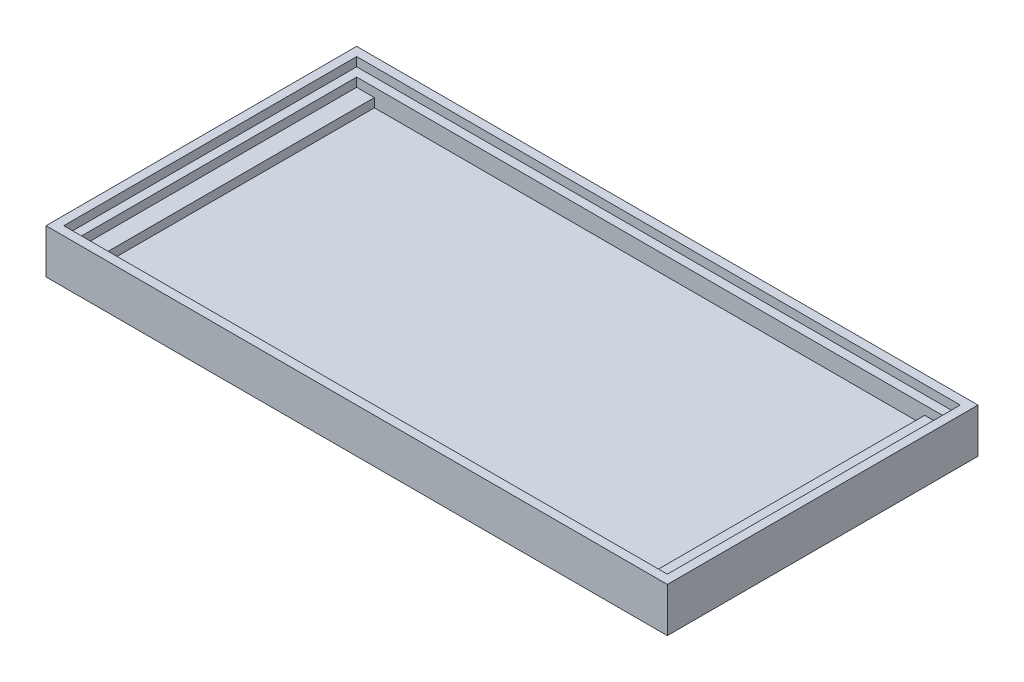
ISO-10303-21;
HEADER;
FILE_DESCRIPTION(('STEP AP214'),'2;1');
FILE_NAME('part.step','',(''),(''),'','','');
FILE_SCHEMA(('AUTOMOTIVE_DESIGN { 1 0 10303 214 1 1 1 1 }'));
ENDSEC;
DATA;
#1=APPLICATION_CONTEXT('core data for automotive mechanical design processes');
#2=APPLICATION_PROTOCOL_DEFINITION('international standard','automotive_design',2000,#1);
#3=PRODUCT_CONTEXT('',#1,'mechanical');
#4=PRODUCT('Part','Part','',(#3));
#5=PRODUCT_RELATED_PRODUCT_CATEGORY('part','',(#4));
#6=PRODUCT_DEFINITION_FORMATION('','',#4);
#7=PRODUCT_DEFINITION_CONTEXT('part definition',#1,'design');
#8=PRODUCT_DEFINITION('design','',#6,#7);
#9=PRODUCT_DEFINITION_SHAPE('','',#8);
#10=(LENGTH_UNIT() NAMED_UNIT(*) SI_UNIT(.MILLI.,.METRE.));
#11=(NAMED_UNIT(*) PLANE_ANGLE_UNIT() SI_UNIT($,.RADIAN.));
#12=(NAMED_UNIT(*) SI_UNIT($,.STERADIAN.) SOLID_ANGLE_UNIT());
#13=UNCERTAINTY_MEASURE_WITH_UNIT(LENGTH_MEASURE(1.E-05),#10,'distance_accuracy_value','');
#14=(GEOMETRIC_REPRESENTATION_CONTEXT(3) GLOBAL_UNCERTAINTY_ASSIGNED_CONTEXT((#13)) GLOBAL_UNIT_ASSIGNED_CONTEXT((#10,
#11,#12)) REPRESENTATION_CONTEXT('',''));
#15=CARTESIAN_POINT('',(0.,0.,0.));
#16=DIRECTION('',(0.,0.,1.));
#17=DIRECTION('',(1.,0.,0.));
#18=AXIS2_PLACEMENT_3D('',#15,#16,#17);
#19=CARTESIAN_POINT('',(66.,4.,-31.));
#20=DIRECTION('',(0.,0.,1.));
#21=DIRECTION('',(1.,0.,0.));
#22=AXIS2_PLACEMENT_3D('',#19,#20,#21);
#23=PLANE('',#22);
#24=DIRECTION('',(-1.,0.,0.));
#25=VECTOR('',#24,1.);
#26=CARTESIAN_POINT('',(66.,2.,-31.));
#27=LINE('',#26,#25);
#28=CARTESIAN_POINT('',(64.,2.,-31.));
#29=VERTEX_POINT('',#28);
#30=CARTESIAN_POINT('',(2.,2.,-31.));
#31=VERTEX_POINT('',#30);
#32=EDGE_CURVE('E229',#29,#31,#27,.T.);
#33=ORIENTED_EDGE('',*,*,#32,.F.);
#34=DIRECTION('',(0.,-1.,0.));
#35=VECTOR('',#34,1.);
#36=CARTESIAN_POINT('',(64.,3.,-31.));
#37=LINE('',#36,#35);
#38=CARTESIAN_POINT('',(64.,3.,-31.));
#39=VERTEX_POINT('',#38);
#40=EDGE_CURVE('E210',#39,#29,#37,.T.);
#41=ORIENTED_EDGE('',*,*,#40,.F.);
#42=DIRECTION('',(-1.,0.,0.));
#43=VECTOR('',#42,1.);
#44=CARTESIAN_POINT('',(66.,3.,-31.));
#45=LINE('',#44,#43);
#46=CARTESIAN_POINT('',(66.,3.,-31.));
#47=VERTEX_POINT('',#46);
#48=EDGE_CURVE('E197',#47,#39,#45,.T.);
#49=ORIENTED_EDGE('',*,*,#48,.F.);
#50=DIRECTION('',(0.,-1.,0.));
#51=VECTOR('',#50,1.);
#52=CARTESIAN_POINT('',(66.,4.,-31.));
#53=LINE('',#52,#51);
#54=CARTESIAN_POINT('',(66.,4.,-31.));
#55=VERTEX_POINT('',#54);
#56=EDGE_CURVE('E252',#55,#47,#53,.T.);
#57=ORIENTED_EDGE('',*,*,#56,.F.);
#58=DIRECTION('',(-1.,0.,0.));
#59=VECTOR('',#58,1.);
#60=CARTESIAN_POINT('',(66.,4.,-31.));
#61=LINE('',#60,#59);
#62=CARTESIAN_POINT('',(0.,4.,-31.));
#63=VERTEX_POINT('',#62);
#64=EDGE_CURVE('E232',#55,#63,#61,.T.);
#65=ORIENTED_EDGE('',*,*,#64,.T.);
#66=DIRECTION('',(0.,-1.,0.));
#67=VECTOR('',#66,1.);
#68=CARTESIAN_POINT('',(0.,4.,-31.));
#69=LINE('',#68,#67);
#70=CARTESIAN_POINT('',(0.,3.,-31.));
#71=VERTEX_POINT('',#70);
#72=EDGE_CURVE('E249',#63,#71,#69,.T.);
#73=ORIENTED_EDGE('',*,*,#72,.T.);
#74=DIRECTION('',(-1.,0.,0.));
#75=VECTOR('',#74,1.);
#76=CARTESIAN_POINT('',(0.,3.,-31.));
#77=LINE('',#76,#75);
#78=CARTESIAN_POINT('',(2.,3.,-31.));
#79=VERTEX_POINT('',#78);
#80=EDGE_CURVE('E220',#79,#71,#77,.T.);
#81=ORIENTED_EDGE('',*,*,#80,.F.);
#82=DIRECTION('',(0.,-1.,0.));
#83=VECTOR('',#82,1.);
#84=CARTESIAN_POINT('',(2.,3.,-31.));
#85=LINE('',#84,#83);
#86=EDGE_CURVE('E222',#79,#31,#85,.T.);
#87=ORIENTED_EDGE('',*,*,#86,.T.);
#88=EDGE_LOOP('',(#33,#41,#49,#57,#65,#73,#81,#87));
#89=FACE_BOUND('',#88,.T.);
#90=ADVANCED_FACE('F33',(#89),#23,.T.);
#91=CARTESIAN_POINT('',(0.,4.,0.));
#92=DIRECTION('',(0.,0.,-1.));
#93=DIRECTION('',(-1.,0.,0.));
#94=AXIS2_PLACEMENT_3D('',#91,#92,#93);
#95=PLANE('',#94);
#96=DIRECTION('',(1.,0.,0.));
#97=VECTOR('',#96,1.);
#98=CARTESIAN_POINT('',(64.,3.,0.));
#99=LINE('',#98,#97);
#100=CARTESIAN_POINT('',(64.,3.,0.));
#101=VERTEX_POINT('',#100);
#102=CARTESIAN_POINT('',(66.,3.,0.));
#103=VERTEX_POINT('',#102);
#104=EDGE_CURVE('E203',#101,#103,#99,.T.);
#105=ORIENTED_EDGE('',*,*,#104,.F.);
#106=DIRECTION('',(0.,-1.,0.));
#107=VECTOR('',#106,1.);
#108=CARTESIAN_POINT('',(64.,3.,0.));
#109=LINE('',#108,#107);
#110=CARTESIAN_POINT('',(64.,2.,0.));
#111=VERTEX_POINT('',#110);
#112=EDGE_CURVE('E206',#101,#111,#109,.T.);
#113=ORIENTED_EDGE('',*,*,#112,.T.);
#114=DIRECTION('',(1.,0.,0.));
#115=VECTOR('',#114,1.);
#116=CARTESIAN_POINT('',(0.,2.,0.));
#117=LINE('',#116,#115);
#118=CARTESIAN_POINT('',(2.,2.,0.));
#119=VERTEX_POINT('',#118);
#120=EDGE_CURVE('E233',#119,#111,#117,.T.);
#121=ORIENTED_EDGE('',*,*,#120,.F.);
#122=DIRECTION('',(0.,-1.,0.));
#123=VECTOR('',#122,1.);
#124=CARTESIAN_POINT('',(2.,3.,0.));
#125=LINE('',#124,#123);
#126=CARTESIAN_POINT('',(2.,3.,0.));
#127=VERTEX_POINT('',#126);
#128=EDGE_CURVE('E227',#127,#119,#125,.T.);
#129=ORIENTED_EDGE('',*,*,#128,.F.);
#130=DIRECTION('',(1.,0.,0.));
#131=VECTOR('',#130,1.);
#132=CARTESIAN_POINT('',(2.,3.,0.));
#133=LINE('',#132,#131);
#134=CARTESIAN_POINT('',(0.,3.,0.));
#135=VERTEX_POINT('',#134);
#136=EDGE_CURVE('E216',#135,#127,#133,.T.);
#137=ORIENTED_EDGE('',*,*,#136,.F.);
#138=DIRECTION('',(0.,-1.,0.));
#139=VECTOR('',#138,1.);
#140=CARTESIAN_POINT('',(0.,4.,0.));
#141=LINE('',#140,#139);
#142=CARTESIAN_POINT('',(0.,4.,0.));
#143=VERTEX_POINT('',#142);
#144=EDGE_CURVE('E246',#143,#135,#141,.T.);
#145=ORIENTED_EDGE('',*,*,#144,.F.);
#146=DIRECTION('',(1.,0.,0.));
#147=VECTOR('',#146,1.);
#148=CARTESIAN_POINT('',(0.,4.,0.));
#149=LINE('',#148,#147);
#150=CARTESIAN_POINT('',(66.,4.,0.));
#151=VERTEX_POINT('',#150);
#152=EDGE_CURVE('E238',#143,#151,#149,.T.);
#153=ORIENTED_EDGE('',*,*,#152,.T.);
#154=DIRECTION('',(0.,-1.,0.));
#155=VECTOR('',#154,1.);
#156=CARTESIAN_POINT('',(66.,4.,0.));
#157=LINE('',#156,#155);
#158=EDGE_CURVE('E240',#151,#103,#157,.T.);
#159=ORIENTED_EDGE('',*,*,#158,.T.);
#160=EDGE_LOOP('',(#105,#113,#121,#129,#137,#145,#153,#159));
#161=FACE_BOUND('',#160,.T.);
#162=ADVANCED_FACE('F293',(#161),#95,.T.);
#163=CARTESIAN_POINT('',(0.,2.,0.));
#164=DIRECTION('',(0.,1.,0.));
#165=DIRECTION('',(0.,0.,1.));
#166=AXIS2_PLACEMENT_3D('',#163,#164,#165);
#167=PLANE('',#166);
#168=ORIENTED_EDGE('',*,*,#120,.T.);
#169=DIRECTION('',(0.,0.,1.));
#170=VECTOR('',#169,1.);
#171=CARTESIAN_POINT('',(64.,2.,-31.));
#172=LINE('',#171,#170);
#173=EDGE_CURVE('E193',#29,#111,#172,.T.);
#174=ORIENTED_EDGE('',*,*,#173,.F.);
#175=ORIENTED_EDGE('',*,*,#32,.T.);
#176=DIRECTION('',(0.,0.,-1.));
#177=VECTOR('',#176,1.);
#178=CARTESIAN_POINT('',(2.,2.,-31.));
#179=LINE('',#178,#177);
#180=EDGE_CURVE('E213',#119,#31,#179,.T.);
#181=ORIENTED_EDGE('',*,*,#180,.F.);
#182=EDGE_LOOP('',(#168,#174,#175,#181));
#183=FACE_BOUND('',#182,.T.);
#184=ADVANCED_FACE('F299',(#183),#167,.T.);
#185=CARTESIAN_POINT('',(0.,4.,-31.));
#186=DIRECTION('',(1.,0.,0.));
#187=DIRECTION('',(0.,0.,-1.));
#188=AXIS2_PLACEMENT_3D('',#185,#186,#187);
#189=PLANE('',#188);
#190=ORIENTED_EDGE('',*,*,#144,.T.);
#191=DIRECTION('',(0.,0.,1.));
#192=VECTOR('',#191,1.);
#193=CARTESIAN_POINT('',(0.,3.,0.));
#194=LINE('',#193,#192);
#195=EDGE_CURVE('E214',#71,#135,#194,.T.);
#196=ORIENTED_EDGE('',*,*,#195,.F.);
#197=ORIENTED_EDGE('',*,*,#72,.F.);
#198=DIRECTION('',(0.,0.,1.));
#199=VECTOR('',#198,1.);
#200=CARTESIAN_POINT('',(0.,4.,-31.));
#201=LINE('',#200,#199);
#202=EDGE_CURVE('E235',#63,#143,#201,.T.);
#203=ORIENTED_EDGE('',*,*,#202,.T.);
#204=EDGE_LOOP('',(#190,#196,#197,#203));
#205=FACE_BOUND('',#204,.T.);
#206=ADVANCED_FACE('F305',(#205),#189,.T.);
#207=CARTESIAN_POINT('',(0.,4.,0.));
#208=DIRECTION('',(0.,1.,0.));
#209=DIRECTION('',(0.,0.,1.));
#210=AXIS2_PLACEMENT_3D('',#207,#208,#209);
#211=PLANE('',#210);
#212=DIRECTION('',(0.,0.,-1.));
#213=VECTOR('',#212,1.);
#214=CARTESIAN_POINT('',(67.,4.,1.));
#215=LINE('',#214,#213);
#216=CARTESIAN_POINT('',(67.,4.,1.));
#217=VERTEX_POINT('',#216);
#218=CARTESIAN_POINT('',(67.,4.,-32.));
#219=VERTEX_POINT('',#218);
#220=EDGE_CURVE('E48',#217,#219,#215,.T.);
#221=ORIENTED_EDGE('',*,*,#220,.T.);
#222=DIRECTION('',(-1.,0.,0.));
#223=VECTOR('',#222,1.);
#224=CARTESIAN_POINT('',(67.,4.,-32.));
#225=LINE('',#224,#223);
#226=CARTESIAN_POINT('',(-1.,4.,-32.));
#227=VERTEX_POINT('',#226);
#228=EDGE_CURVE('E52',#219,#227,#225,.T.);
#229=ORIENTED_EDGE('',*,*,#228,.T.);
#230=DIRECTION('',(0.,0.,1.));
#231=VECTOR('',#230,1.);
#232=CARTESIAN_POINT('',(-1.,4.,-32.));
#233=LINE('',#232,#231);
#234=CARTESIAN_POINT('',(-1.,4.,1.));
#235=VERTEX_POINT('',#234);
#236=EDGE_CURVE('E174',#227,#235,#233,.T.);
#237=ORIENTED_EDGE('',*,*,#236,.T.);
#238=DIRECTION('',(1.,0.,0.));
#239=VECTOR('',#238,1.);
#240=CARTESIAN_POINT('',(-1.,4.,1.));
#241=LINE('',#240,#239);
#242=EDGE_CURVE('E155',#235,#217,#241,.T.);
#243=ORIENTED_EDGE('',*,*,#242,.T.);
#244=EDGE_LOOP('',(#221,#229,#237,#243));
#245=FACE_BOUND('',#244,.T.);
#246=ORIENTED_EDGE('',*,*,#64,.F.);
#247=DIRECTION('',(0.,0.,-1.));
#248=VECTOR('',#247,1.);
#249=CARTESIAN_POINT('',(66.,4.,0.));
#250=LINE('',#249,#248);
#251=EDGE_CURVE('E230',#151,#55,#250,.T.);
#252=ORIENTED_EDGE('',*,*,#251,.F.);
#253=ORIENTED_EDGE('',*,*,#152,.F.);
#254=ORIENTED_EDGE('',*,*,#202,.F.);
#255=EDGE_LOOP('',(#246,#252,#253,#254));
#256=FACE_BOUND('',#255,.T.);
#257=ADVANCED_FACE('F310',(#245,#256),#211,.T.);
#258=CARTESIAN_POINT('',(66.,4.,0.));
#259=DIRECTION('',(-1.,0.,0.));
#260=DIRECTION('',(0.,0.,1.));
#261=AXIS2_PLACEMENT_3D('',#258,#259,#260);
#262=PLANE('',#261);
#263=DIRECTION('',(0.,0.,-1.));
#264=VECTOR('',#263,1.);
#265=CARTESIAN_POINT('',(66.,3.,0.));
#266=LINE('',#265,#264);
#267=EDGE_CURVE('E194',#103,#47,#266,.T.);
#268=ORIENTED_EDGE('',*,*,#267,.F.);
#269=ORIENTED_EDGE('',*,*,#158,.F.);
#270=ORIENTED_EDGE('',*,*,#251,.T.);
#271=ORIENTED_EDGE('',*,*,#56,.T.);
#272=EDGE_LOOP('',(#268,#269,#270,#271));
#273=FACE_BOUND('',#272,.T.);
#274=ADVANCED_FACE('F306',(#273),#262,.T.);
#275=CARTESIAN_POINT('',(2.,3.,-31.));
#276=DIRECTION('',(-1.,0.,0.));
#277=DIRECTION('',(0.,0.,1.));
#278=AXIS2_PLACEMENT_3D('',#275,#276,#277);
#279=PLANE('',#278);
#280=ORIENTED_EDGE('',*,*,#180,.T.);
#281=ORIENTED_EDGE('',*,*,#86,.F.);
#282=DIRECTION('',(0.,0.,-1.));
#283=VECTOR('',#282,1.);
#284=CARTESIAN_POINT('',(2.,3.,-31.));
#285=LINE('',#284,#283);
#286=EDGE_CURVE('E218',#127,#79,#285,.T.);
#287=ORIENTED_EDGE('',*,*,#286,.F.);
#288=ORIENTED_EDGE('',*,*,#128,.T.);
#289=EDGE_LOOP('',(#280,#281,#287,#288));
#290=FACE_BOUND('',#289,.T.);
#291=ADVANCED_FACE('F309',(#290),#279,.F.);
#292=CARTESIAN_POINT('',(0.,3.,0.));
#293=DIRECTION('',(0.,-1.,0.));
#294=DIRECTION('',(0.,0.,-1.));
#295=AXIS2_PLACEMENT_3D('',#292,#293,#294);
#296=PLANE('',#295);
#297=ORIENTED_EDGE('',*,*,#195,.T.);
#298=ORIENTED_EDGE('',*,*,#136,.T.);
#299=ORIENTED_EDGE('',*,*,#286,.T.);
#300=ORIENTED_EDGE('',*,*,#80,.T.);
#301=EDGE_LOOP('',(#297,#298,#299,#300));
#302=FACE_BOUND('',#301,.T.);
#303=ADVANCED_FACE('F414',(#302),#296,.F.);
#304=CARTESIAN_POINT('',(64.,3.,-31.));
#305=DIRECTION('',(1.,0.,0.));
#306=DIRECTION('',(0.,0.,-1.));
#307=AXIS2_PLACEMENT_3D('',#304,#305,#306);
#308=PLANE('',#307);
#309=ORIENTED_EDGE('',*,*,#173,.T.);
#310=ORIENTED_EDGE('',*,*,#112,.F.);
#311=DIRECTION('',(0.,0.,1.));
#312=VECTOR('',#311,1.);
#313=CARTESIAN_POINT('',(64.,3.,-31.));
#314=LINE('',#313,#312);
#315=EDGE_CURVE('E200',#39,#101,#314,.T.);
#316=ORIENTED_EDGE('',*,*,#315,.F.);
#317=ORIENTED_EDGE('',*,*,#40,.T.);
#318=EDGE_LOOP('',(#309,#310,#316,#317));
#319=FACE_BOUND('',#318,.T.);
#320=ADVANCED_FACE('F423',(#319),#308,.F.);
#321=CARTESIAN_POINT('',(0.,3.,0.));
#322=DIRECTION('',(0.,1.,0.));
#323=DIRECTION('',(0.,0.,1.));
#324=AXIS2_PLACEMENT_3D('',#321,#322,#323);
#325=PLANE('',#324);
#326=ORIENTED_EDGE('',*,*,#267,.T.);
#327=ORIENTED_EDGE('',*,*,#48,.T.);
#328=ORIENTED_EDGE('',*,*,#315,.T.);
#329=ORIENTED_EDGE('',*,*,#104,.T.);
#330=EDGE_LOOP('',(#326,#327,#328,#329));
#331=FACE_BOUND('',#330,.T.);
#332=ADVANCED_FACE('F432',(#331),#325,.T.);
#333=CARTESIAN_POINT('',(0.,5.,0.));
#334=DIRECTION('',(0.,1.,0.));
#335=DIRECTION('',(0.,0.,1.));
#336=AXIS2_PLACEMENT_3D('',#333,#334,#335);
#337=PLANE('',#336);
#338=DIRECTION('',(0.,0.,-1.));
#339=VECTOR('',#338,1.);
#340=CARTESIAN_POINT('',(68.,5.,2.));
#341=LINE('',#340,#339);
#342=CARTESIAN_POINT('',(68.,5.,2.));
#343=VERTEX_POINT('',#342);
#344=CARTESIAN_POINT('',(68.,5.,-33.));
#345=VERTEX_POINT('',#344);
#346=EDGE_CURVE('E160',#343,#345,#341,.T.);
#347=ORIENTED_EDGE('',*,*,#346,.T.);
#348=DIRECTION('',(-1.,0.,0.));
#349=VECTOR('',#348,1.);
#350=CARTESIAN_POINT('',(68.,5.,-33.));
#351=LINE('',#350,#349);
#352=CARTESIAN_POINT('',(-2.,5.,-33.));
#353=VERTEX_POINT('',#352);
#354=EDGE_CURVE('E184',#345,#353,#351,.T.);
#355=ORIENTED_EDGE('',*,*,#354,.T.);
#356=DIRECTION('',(0.,0.,1.));
#357=VECTOR('',#356,1.);
#358=CARTESIAN_POINT('',(-2.,5.,-33.));
#359=LINE('',#358,#357);
#360=CARTESIAN_POINT('',(-2.,5.,2.));
#361=VERTEX_POINT('',#360);
#362=EDGE_CURVE('E187',#353,#361,#359,.T.);
#363=ORIENTED_EDGE('',*,*,#362,.T.);
#364=DIRECTION('',(1.,0.,0.));
#365=VECTOR('',#364,1.);
#366=CARTESIAN_POINT('',(-2.,5.,2.));
#367=LINE('',#366,#365);
#368=EDGE_CURVE('E190',#361,#343,#367,.T.);
#369=ORIENTED_EDGE('',*,*,#368,.T.);
#370=EDGE_LOOP('',(#347,#355,#363,#369));
#371=FACE_BOUND('',#370,.T.);
#372=DIRECTION('',(-1.,0.,0.));
#373=VECTOR('',#372,1.);
#374=CARTESIAN_POINT('',(67.,5.,-32.));
#375=LINE('',#374,#373);
#376=CARTESIAN_POINT('',(67.,5.,-32.));
#377=VERTEX_POINT('',#376);
#378=CARTESIAN_POINT('',(-1.,5.,-32.));
#379=VERTEX_POINT('',#378);
#380=EDGE_CURVE('E154',#377,#379,#375,.T.);
#381=ORIENTED_EDGE('',*,*,#380,.F.);
#382=DIRECTION('',(0.,0.,-1.));
#383=VECTOR('',#382,1.);
#384=CARTESIAN_POINT('',(67.,5.,1.));
#385=LINE('',#384,#383);
#386=CARTESIAN_POINT('',(67.,5.,1.));
#387=VERTEX_POINT('',#386);
#388=EDGE_CURVE('E145',#387,#377,#385,.T.);
#389=ORIENTED_EDGE('',*,*,#388,.F.);
#390=DIRECTION('',(1.,0.,0.));
#391=VECTOR('',#390,1.);
#392=CARTESIAN_POINT('',(-1.,5.,1.));
#393=LINE('',#392,#391);
#394=CARTESIAN_POINT('',(-1.,5.,1.));
#395=VERTEX_POINT('',#394);
#396=EDGE_CURVE('E168',#395,#387,#393,.T.);
#397=ORIENTED_EDGE('',*,*,#396,.F.);
#398=DIRECTION('',(0.,0.,1.));
#399=VECTOR('',#398,1.);
#400=CARTESIAN_POINT('',(-1.,5.,-32.));
#401=LINE('',#400,#399);
#402=EDGE_CURVE('E166',#379,#395,#401,.T.);
#403=ORIENTED_EDGE('',*,*,#402,.F.);
#404=EDGE_LOOP('',(#381,#389,#397,#403));
#405=FACE_BOUND('',#404,.T.);
#406=ADVANCED_FACE('F164',(#371,#405),#337,.T.);
#407=CARTESIAN_POINT('',(67.,5.,1.));
#408=DIRECTION('',(-1.,0.,0.));
#409=DIRECTION('',(0.,0.,1.));
#410=AXIS2_PLACEMENT_3D('',#407,#408,#409);
#411=PLANE('',#410);
#412=ORIENTED_EDGE('',*,*,#220,.F.);
#413=DIRECTION('',(0.,-1.,0.));
#414=VECTOR('',#413,1.);
#415=CARTESIAN_POINT('',(67.,5.,1.));
#416=LINE('',#415,#414);
#417=EDGE_CURVE('E150',#387,#217,#416,.T.);
#418=ORIENTED_EDGE('',*,*,#417,.F.);
#419=ORIENTED_EDGE('',*,*,#388,.T.);
#420=DIRECTION('',(0.,-1.,0.));
#421=VECTOR('',#420,1.);
#422=CARTESIAN_POINT('',(67.,5.,-32.));
#423=LINE('',#422,#421);
#424=EDGE_CURVE('E148',#377,#219,#423,.T.);
#425=ORIENTED_EDGE('',*,*,#424,.T.);
#426=EDGE_LOOP('',(#412,#418,#419,#425));
#427=FACE_BOUND('',#426,.T.);
#428=ADVANCED_FACE('F147',(#427),#411,.T.);
#429=CARTESIAN_POINT('',(67.,5.,-32.));
#430=DIRECTION('',(0.,0.,1.));
#431=DIRECTION('',(1.,0.,0.));
#432=AXIS2_PLACEMENT_3D('',#429,#430,#431);
#433=PLANE('',#432);
#434=ORIENTED_EDGE('',*,*,#228,.F.);
#435=ORIENTED_EDGE('',*,*,#424,.F.);
#436=ORIENTED_EDGE('',*,*,#380,.T.);
#437=DIRECTION('',(0.,-1.,0.));
#438=VECTOR('',#437,1.);
#439=CARTESIAN_POINT('',(-1.,5.,-32.));
#440=LINE('',#439,#438);
#441=EDGE_CURVE('E161',#379,#227,#440,.T.);
#442=ORIENTED_EDGE('',*,*,#441,.T.);
#443=EDGE_LOOP('',(#434,#435,#436,#442));
#444=FACE_BOUND('',#443,.T.);
#445=ADVANCED_FACE('F158',(#444),#433,.T.);
#446=CARTESIAN_POINT('',(-1.,5.,-32.));
#447=DIRECTION('',(1.,0.,0.));
#448=DIRECTION('',(0.,0.,-1.));
#449=AXIS2_PLACEMENT_3D('',#446,#447,#448);
#450=PLANE('',#449);
#451=ORIENTED_EDGE('',*,*,#236,.F.);
#452=ORIENTED_EDGE('',*,*,#441,.F.);
#453=ORIENTED_EDGE('',*,*,#402,.T.);
#454=DIRECTION('',(0.,-1.,0.));
#455=VECTOR('',#454,1.);
#456=CARTESIAN_POINT('',(-1.,5.,1.));
#457=LINE('',#456,#455);
#458=EDGE_CURVE('E178',#395,#235,#457,.T.);
#459=ORIENTED_EDGE('',*,*,#458,.T.);
#460=EDGE_LOOP('',(#451,#452,#453,#459));
#461=FACE_BOUND('',#460,.T.);
#462=ADVANCED_FACE('F461',(#461),#450,.T.);
#463=CARTESIAN_POINT('',(-1.,5.,1.));
#464=DIRECTION('',(0.,0.,-1.));
#465=DIRECTION('',(-1.,0.,0.));
#466=AXIS2_PLACEMENT_3D('',#463,#464,#465);
#467=PLANE('',#466);
#468=ORIENTED_EDGE('',*,*,#242,.F.);
#469=ORIENTED_EDGE('',*,*,#458,.F.);
#470=ORIENTED_EDGE('',*,*,#396,.T.);
#471=ORIENTED_EDGE('',*,*,#417,.T.);
#472=EDGE_LOOP('',(#468,#469,#470,#471));
#473=FACE_BOUND('',#472,.T.);
#474=ADVANCED_FACE('F319',(#473),#467,.T.);
#475=CARTESIAN_POINT('',(0.,0.,0.));
#476=DIRECTION('',(0.,1.,0.));
#477=DIRECTION('',(0.,0.,1.));
#478=AXIS2_PLACEMENT_3D('',#475,#476,#477);
#479=PLANE('',#478);
#480=DIRECTION('',(0.,0.,-1.));
#481=VECTOR('',#480,1.);
#482=CARTESIAN_POINT('',(68.,0.,2.));
#483=LINE('',#482,#481);
#484=CARTESIAN_POINT('',(68.,0.,2.));
#485=VERTEX_POINT('',#484);
#486=CARTESIAN_POINT('',(68.,0.,-33.));
#487=VERTEX_POINT('',#486);
#488=EDGE_CURVE('E254',#485,#487,#483,.T.);
#489=ORIENTED_EDGE('',*,*,#488,.F.);
#490=DIRECTION('',(1.,0.,0.));
#491=VECTOR('',#490,1.);
#492=CARTESIAN_POINT('',(-2.,0.,2.));
#493=LINE('',#492,#491);
#494=CARTESIAN_POINT('',(-2.,0.,2.));
#495=VERTEX_POINT('',#494);
#496=EDGE_CURVE('E261',#495,#485,#493,.T.);
#497=ORIENTED_EDGE('',*,*,#496,.F.);
#498=DIRECTION('',(0.,0.,1.));
#499=VECTOR('',#498,1.);
#500=CARTESIAN_POINT('',(-2.,0.,-33.));
#501=LINE('',#500,#499);
#502=CARTESIAN_POINT('',(-2.,0.,-33.));
#503=VERTEX_POINT('',#502);
#504=EDGE_CURVE('E259',#503,#495,#501,.T.);
#505=ORIENTED_EDGE('',*,*,#504,.F.);
#506=DIRECTION('',(-1.,0.,0.));
#507=VECTOR('',#506,1.);
#508=CARTESIAN_POINT('',(68.,0.,-33.));
#509=LINE('',#508,#507);
#510=EDGE_CURVE('E257',#487,#503,#509,.T.);
#511=ORIENTED_EDGE('',*,*,#510,.F.);
#512=EDGE_LOOP('',(#489,#497,#505,#511));
#513=FACE_BOUND('',#512,.T.);
#514=ADVANCED_FACE('F278',(#513),#479,.F.);
#515=CARTESIAN_POINT('',(-2.,2.,2.));
#516=DIRECTION('',(0.,0.,-1.));
#517=DIRECTION('',(-1.,0.,0.));
#518=AXIS2_PLACEMENT_3D('',#515,#516,#517);
#519=PLANE('',#518);
#520=ORIENTED_EDGE('',*,*,#496,.T.);
#521=DIRECTION('',(0.,-1.,0.));
#522=VECTOR('',#521,1.);
#523=CARTESIAN_POINT('',(68.,2.,2.));
#524=LINE('',#523,#522);
#525=EDGE_CURVE('E263',#343,#485,#524,.T.);
#526=ORIENTED_EDGE('',*,*,#525,.F.);
#527=ORIENTED_EDGE('',*,*,#368,.F.);
#528=DIRECTION('',(0.,-1.,0.));
#529=VECTOR('',#528,1.);
#530=CARTESIAN_POINT('',(-2.,2.,2.));
#531=LINE('',#530,#529);
#532=EDGE_CURVE('E266',#361,#495,#531,.T.);
#533=ORIENTED_EDGE('',*,*,#532,.T.);
#534=EDGE_LOOP('',(#520,#526,#527,#533));
#535=FACE_BOUND('',#534,.T.);
#536=ADVANCED_FACE('F280',(#535),#519,.F.);
#537=CARTESIAN_POINT('',(-2.,2.,-33.));
#538=DIRECTION('',(1.,0.,0.));
#539=DIRECTION('',(0.,0.,-1.));
#540=AXIS2_PLACEMENT_3D('',#537,#538,#539);
#541=PLANE('',#540);
#542=ORIENTED_EDGE('',*,*,#504,.T.);
#543=ORIENTED_EDGE('',*,*,#532,.F.);
#544=ORIENTED_EDGE('',*,*,#362,.F.);
#545=DIRECTION('',(0.,-1.,0.));
#546=VECTOR('',#545,1.);
#547=CARTESIAN_POINT('',(-2.,2.,-33.));
#548=LINE('',#547,#546);
#549=EDGE_CURVE('E41',#353,#503,#548,.T.);
#550=ORIENTED_EDGE('',*,*,#549,.T.);
#551=EDGE_LOOP('',(#542,#543,#544,#550));
#552=FACE_BOUND('',#551,.T.);
#553=ADVANCED_FACE('F272',(#552),#541,.F.);
#554=CARTESIAN_POINT('',(68.,2.,-33.));
#555=DIRECTION('',(0.,0.,1.));
#556=DIRECTION('',(1.,0.,0.));
#557=AXIS2_PLACEMENT_3D('',#554,#555,#556);
#558=PLANE('',#557);
#559=ORIENTED_EDGE('',*,*,#510,.T.);
#560=ORIENTED_EDGE('',*,*,#549,.F.);
#561=ORIENTED_EDGE('',*,*,#354,.F.);
#562=DIRECTION('',(0.,-1.,0.));
#563=VECTOR('',#562,1.);
#564=CARTESIAN_POINT('',(68.,2.,-33.));
#565=LINE('',#564,#563);
#566=EDGE_CURVE('E11',#345,#487,#565,.T.);
#567=ORIENTED_EDGE('',*,*,#566,.T.);
#568=EDGE_LOOP('',(#559,#560,#561,#567));
#569=FACE_BOUND('',#568,.T.);
#570=ADVANCED_FACE('F285',(#569),#558,.F.);
#571=CARTESIAN_POINT('',(68.,2.,2.));
#572=DIRECTION('',(-1.,0.,0.));
#573=DIRECTION('',(0.,0.,1.));
#574=AXIS2_PLACEMENT_3D('',#571,#572,#573);
#575=PLANE('',#574);
#576=ORIENTED_EDGE('',*,*,#488,.T.);
#577=ORIENTED_EDGE('',*,*,#566,.F.);
#578=ORIENTED_EDGE('',*,*,#346,.F.);
#579=ORIENTED_EDGE('',*,*,#525,.T.);
#580=EDGE_LOOP('',(#576,#577,#578,#579));
#581=FACE_BOUND('',#580,.T.);
#582=ADVANCED_FACE('F35',(#581),#575,.F.);
#583=CLOSED_SHELL('',(#90,#162,#184,#206,#257,#274,#291,#303,#320,#332,#406,#428,#445,#462,#474,
#514,#536,#553,#570,#582));
#584=MANIFOLD_SOLID_BREP('B2',#583);
#585=ADVANCED_BREP_SHAPE_REPRESENTATION('',(#18,#584),#14);
#586=SHAPE_DEFINITION_REPRESENTATION(#9,#585);
ENDSEC;
END-ISO-10303-21;
